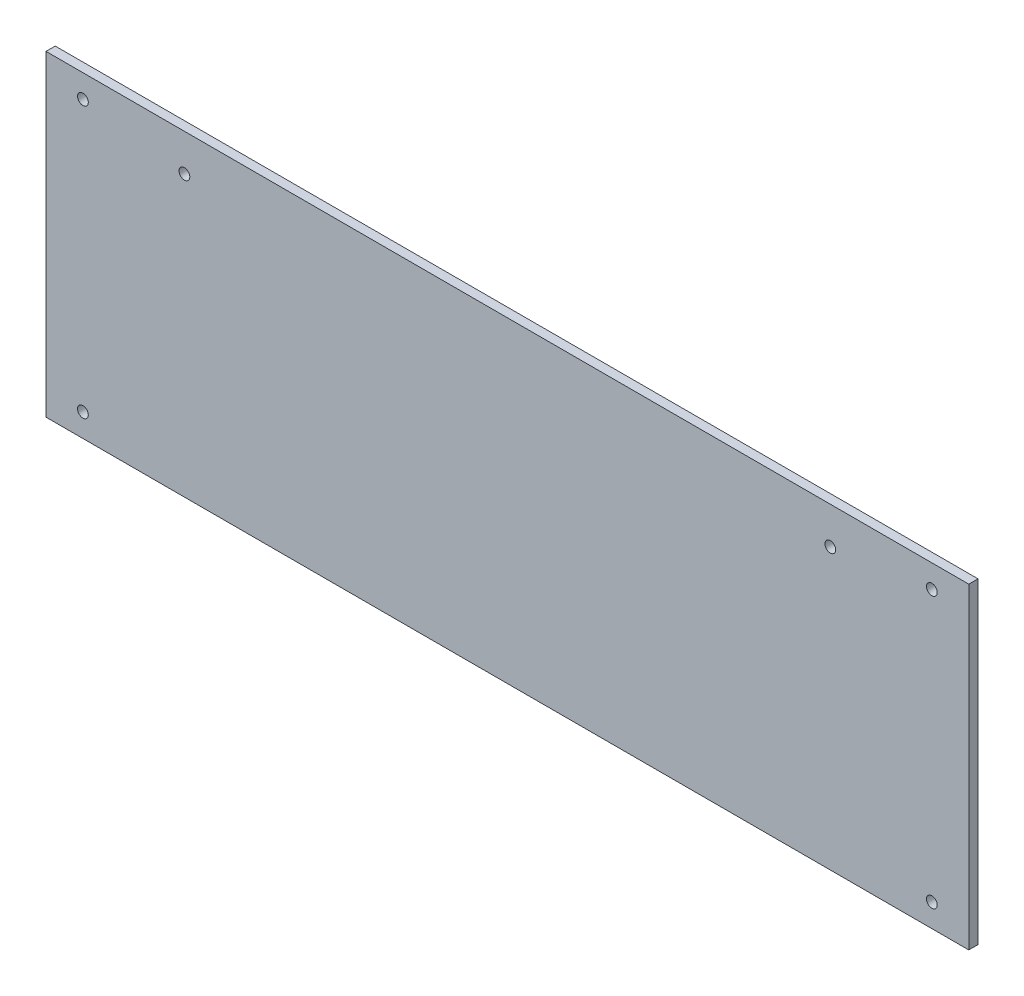
ISO-10303-21;
HEADER;
FILE_DESCRIPTION(('STEP AP214'),'2;1');
FILE_NAME('part.step','',(''),(''),'','','');
FILE_SCHEMA(('AUTOMOTIVE_DESIGN { 1 0 10303 214 1 1 1 1 }'));
ENDSEC;
DATA;
#1=APPLICATION_CONTEXT('core data for automotive mechanical design processes');
#2=APPLICATION_PROTOCOL_DEFINITION('international standard','automotive_design',2000,#1);
#3=PRODUCT_CONTEXT('',#1,'mechanical');
#4=PRODUCT('Part','Part','',(#3));
#5=PRODUCT_RELATED_PRODUCT_CATEGORY('part','',(#4));
#6=PRODUCT_DEFINITION_FORMATION('','',#4);
#7=PRODUCT_DEFINITION_CONTEXT('part definition',#1,'design');
#8=PRODUCT_DEFINITION('design','',#6,#7);
#9=PRODUCT_DEFINITION_SHAPE('','',#8);
#10=(LENGTH_UNIT() NAMED_UNIT(*) SI_UNIT(.MILLI.,.METRE.));
#11=(NAMED_UNIT(*) PLANE_ANGLE_UNIT() SI_UNIT($,.RADIAN.));
#12=(NAMED_UNIT(*) SI_UNIT($,.STERADIAN.) SOLID_ANGLE_UNIT());
#13=UNCERTAINTY_MEASURE_WITH_UNIT(LENGTH_MEASURE(1.E-05),#10,'distance_accuracy_value','');
#14=(GEOMETRIC_REPRESENTATION_CONTEXT(3) GLOBAL_UNCERTAINTY_ASSIGNED_CONTEXT((#13)) GLOBAL_UNIT_ASSIGNED_CONTEXT((#10,
#11,#12)) REPRESENTATION_CONTEXT('',''));
#15=CARTESIAN_POINT('',(0.,0.,0.));
#16=DIRECTION('',(0.,0.,1.));
#17=DIRECTION('',(1.,0.,0.));
#18=AXIS2_PLACEMENT_3D('',#15,#16,#17);
#19=CARTESIAN_POINT('',(0.,100.,0.));
#20=DIRECTION('',(-1.,0.,0.));
#21=DIRECTION('',(0.,0.,1.));
#22=AXIS2_PLACEMENT_3D('',#19,#20,#21);
#23=PLANE('',#22);
#24=DIRECTION('',(0.,-1.,0.));
#25=VECTOR('',#24,1.);
#26=CARTESIAN_POINT('',(0.,100.,3.));
#27=LINE('',#26,#25);
#28=CARTESIAN_POINT('',(0.,100.,3.));
#29=VERTEX_POINT('',#28);
#30=CARTESIAN_POINT('',(0.,-3.,3.));
#31=VERTEX_POINT('',#30);
#32=EDGE_CURVE('E98',#29,#31,#27,.T.);
#33=ORIENTED_EDGE('',*,*,#32,.F.);
#34=DIRECTION('',(0.,0.,1.));
#35=VECTOR('',#34,1.);
#36=CARTESIAN_POINT('',(0.,100.,0.));
#37=LINE('',#36,#35);
#38=CARTESIAN_POINT('',(0.,100.,0.));
#39=VERTEX_POINT('',#38);
#40=EDGE_CURVE('E11',#39,#29,#37,.T.);
#41=ORIENTED_EDGE('',*,*,#40,.F.);
#42=DIRECTION('',(0.,-1.,0.));
#43=VECTOR('',#42,1.);
#44=CARTESIAN_POINT('',(0.,100.,0.));
#45=LINE('',#44,#43);
#46=CARTESIAN_POINT('',(0.,-3.,0.));
#47=VERTEX_POINT('',#46);
#48=EDGE_CURVE('E91',#39,#47,#45,.T.);
#49=ORIENTED_EDGE('',*,*,#48,.T.);
#50=DIRECTION('',(0.,0.,1.));
#51=VECTOR('',#50,1.);
#52=CARTESIAN_POINT('',(0.,-3.,0.));
#53=LINE('',#52,#51);
#54=EDGE_CURVE('E36',#47,#31,#53,.T.);
#55=ORIENTED_EDGE('',*,*,#54,.T.);
#56=EDGE_LOOP('',(#33,#41,#49,#55));
#57=FACE_BOUND('',#56,.T.);
#58=ADVANCED_FACE('F33',(#57),#23,.T.);
#59=CARTESIAN_POINT('',(300.,100.,0.));
#60=DIRECTION('',(0.,1.,0.));
#61=DIRECTION('',(0.,0.,1.));
#62=AXIS2_PLACEMENT_3D('',#59,#60,#61);
#63=PLANE('',#62);
#64=DIRECTION('',(-1.,0.,0.));
#65=VECTOR('',#64,1.);
#66=CARTESIAN_POINT('',(300.,100.,3.));
#67=LINE('',#66,#65);
#68=CARTESIAN_POINT('',(300.,100.,3.));
#69=VERTEX_POINT('',#68);
#70=EDGE_CURVE('E93',#69,#29,#67,.T.);
#71=ORIENTED_EDGE('',*,*,#70,.F.);
#72=DIRECTION('',(0.,0.,1.));
#73=VECTOR('',#72,1.);
#74=CARTESIAN_POINT('',(300.,100.,0.));
#75=LINE('',#74,#73);
#76=CARTESIAN_POINT('',(300.,100.,0.));
#77=VERTEX_POINT('',#76);
#78=EDGE_CURVE('E42',#77,#69,#75,.T.);
#79=ORIENTED_EDGE('',*,*,#78,.F.);
#80=DIRECTION('',(-1.,0.,0.));
#81=VECTOR('',#80,1.);
#82=CARTESIAN_POINT('',(300.,100.,0.));
#83=LINE('',#82,#81);
#84=EDGE_CURVE('E88',#77,#39,#83,.T.);
#85=ORIENTED_EDGE('',*,*,#84,.T.);
#86=ORIENTED_EDGE('',*,*,#40,.T.);
#87=EDGE_LOOP('',(#71,#79,#85,#86));
#88=FACE_BOUND('',#87,.T.);
#89=ADVANCED_FACE('F109',(#88),#63,.T.);
#90=CARTESIAN_POINT('',(300.,-3.,0.));
#91=DIRECTION('',(1.,0.,0.));
#92=DIRECTION('',(0.,0.,-1.));
#93=AXIS2_PLACEMENT_3D('',#90,#91,#92);
#94=PLANE('',#93);
#95=DIRECTION('',(0.,1.,0.));
#96=VECTOR('',#95,1.);
#97=CARTESIAN_POINT('',(300.,-3.,3.));
#98=LINE('',#97,#96);
#99=CARTESIAN_POINT('',(300.,-3.,3.));
#100=VERTEX_POINT('',#99);
#101=EDGE_CURVE('E83',#100,#69,#98,.T.);
#102=ORIENTED_EDGE('',*,*,#101,.F.);
#103=DIRECTION('',(0.,0.,1.));
#104=VECTOR('',#103,1.);
#105=CARTESIAN_POINT('',(300.,-3.,0.));
#106=LINE('',#105,#104);
#107=CARTESIAN_POINT('',(300.,-3.,0.));
#108=VERTEX_POINT('',#107);
#109=EDGE_CURVE('E78',#108,#100,#106,.T.);
#110=ORIENTED_EDGE('',*,*,#109,.F.);
#111=DIRECTION('',(0.,1.,0.));
#112=VECTOR('',#111,1.);
#113=CARTESIAN_POINT('',(300.,-3.,0.));
#114=LINE('',#113,#112);
#115=EDGE_CURVE('E81',#108,#77,#114,.T.);
#116=ORIENTED_EDGE('',*,*,#115,.T.);
#117=ORIENTED_EDGE('',*,*,#78,.T.);
#118=EDGE_LOOP('',(#102,#110,#116,#117));
#119=FACE_BOUND('',#118,.T.);
#120=ADVANCED_FACE('F80',(#119),#94,.T.);
#121=CARTESIAN_POINT('',(0.,-3.,0.));
#122=DIRECTION('',(0.,-1.,0.));
#123=DIRECTION('',(0.,0.,-1.));
#124=AXIS2_PLACEMENT_3D('',#121,#122,#123);
#125=PLANE('',#124);
#126=DIRECTION('',(1.,0.,0.));
#127=VECTOR('',#126,1.);
#128=CARTESIAN_POINT('',(0.,-3.,3.));
#129=LINE('',#128,#127);
#130=EDGE_CURVE('E101',#31,#100,#129,.T.);
#131=ORIENTED_EDGE('',*,*,#130,.F.);
#132=ORIENTED_EDGE('',*,*,#54,.F.);
#133=DIRECTION('',(1.,0.,0.));
#134=VECTOR('',#133,1.);
#135=CARTESIAN_POINT('',(0.,-3.,0.));
#136=LINE('',#135,#134);
#137=EDGE_CURVE('E87',#47,#108,#136,.T.);
#138=ORIENTED_EDGE('',*,*,#137,.T.);
#139=ORIENTED_EDGE('',*,*,#109,.T.);
#140=EDGE_LOOP('',(#131,#132,#138,#139));
#141=FACE_BOUND('',#140,.T.);
#142=ADVANCED_FACE('F90',(#141),#125,.T.);
#143=CARTESIAN_POINT('',(0.,0.,0.));
#144=DIRECTION('',(0.,0.,1.));
#145=DIRECTION('',(1.,0.,0.));
#146=AXIS2_PLACEMENT_3D('',#143,#144,#145);
#147=PLANE('',#146);
#148=CARTESIAN_POINT('',(255.,88.,0.));
#149=DIRECTION('',(0.,0.,1.));
#150=DIRECTION('',(-1.,0.,0.));
#151=AXIS2_PLACEMENT_3D('',#148,#149,#150);
#152=CIRCLE('',#151,1.75000000000003);
#153=CARTESIAN_POINT('',(253.25,88.,0.));
#154=VERTEX_POINT('',#153);
#155=EDGE_CURVE('E158',#154,#154,#152,.T.);
#156=ORIENTED_EDGE('',*,*,#155,.T.);
#157=EDGE_LOOP('',(#156));
#158=FACE_BOUND('',#157,.T.);
#159=CARTESIAN_POINT('',(45.,88.,0.));
#160=DIRECTION('',(0.,0.,1.));
#161=DIRECTION('',(-1.,0.,0.));
#162=AXIS2_PLACEMENT_3D('',#159,#160,#161);
#163=CIRCLE('',#162,1.75);
#164=CARTESIAN_POINT('',(43.25,88.,0.));
#165=VERTEX_POINT('',#164);
#166=EDGE_CURVE('E166',#165,#165,#163,.T.);
#167=ORIENTED_EDGE('',*,*,#166,.T.);
#168=EDGE_LOOP('',(#167));
#169=FACE_BOUND('',#168,.T.);
#170=CARTESIAN_POINT('',(288.,4.5,0.));
#171=DIRECTION('',(0.,0.,1.));
#172=DIRECTION('',(-1.,0.,0.));
#173=AXIS2_PLACEMENT_3D('',#170,#171,#172);
#174=CIRCLE('',#173,1.74999999999997);
#175=CARTESIAN_POINT('',(286.25,4.5,0.));
#176=VERTEX_POINT('',#175);
#177=EDGE_CURVE('E172',#176,#176,#174,.T.);
#178=ORIENTED_EDGE('',*,*,#177,.T.);
#179=EDGE_LOOP('',(#178));
#180=FACE_BOUND('',#179,.T.);
#181=CARTESIAN_POINT('',(12.,4.50000000000003,0.));
#182=DIRECTION('',(0.,0.,1.));
#183=DIRECTION('',(-1.,0.,0.));
#184=AXIS2_PLACEMENT_3D('',#181,#182,#183);
#185=CIRCLE('',#184,1.74999999999998);
#186=CARTESIAN_POINT('',(10.25,4.50000000000003,0.));
#187=VERTEX_POINT('',#186);
#188=EDGE_CURVE('E178',#187,#187,#185,.T.);
#189=ORIENTED_EDGE('',*,*,#188,.T.);
#190=EDGE_LOOP('',(#189));
#191=FACE_BOUND('',#190,.T.);
#192=CARTESIAN_POINT('',(12.,92.5,0.));
#193=DIRECTION('',(0.,0.,1.));
#194=DIRECTION('',(-1.,0.,0.));
#195=AXIS2_PLACEMENT_3D('',#192,#193,#194);
#196=CIRCLE('',#195,1.74999999999998);
#197=CARTESIAN_POINT('',(10.25,92.5,0.));
#198=VERTEX_POINT('',#197);
#199=EDGE_CURVE('E184',#198,#198,#196,.T.);
#200=ORIENTED_EDGE('',*,*,#199,.T.);
#201=EDGE_LOOP('',(#200));
#202=FACE_BOUND('',#201,.T.);
#203=CARTESIAN_POINT('',(288.,92.5,0.));
#204=DIRECTION('',(0.,0.,1.));
#205=DIRECTION('',(-1.,0.,0.));
#206=AXIS2_PLACEMENT_3D('',#203,#204,#205);
#207=CIRCLE('',#206,1.74999999999997);
#208=CARTESIAN_POINT('',(286.25,92.5,0.));
#209=VERTEX_POINT('',#208);
#210=EDGE_CURVE('E102',#209,#209,#207,.T.);
#211=ORIENTED_EDGE('',*,*,#210,.T.);
#212=EDGE_LOOP('',(#211));
#213=FACE_BOUND('',#212,.T.);
#214=ORIENTED_EDGE('',*,*,#48,.F.);
#215=ORIENTED_EDGE('',*,*,#84,.F.);
#216=ORIENTED_EDGE('',*,*,#115,.F.);
#217=ORIENTED_EDGE('',*,*,#137,.F.);
#218=EDGE_LOOP('',(#214,#215,#216,#217));
#219=FACE_BOUND('',#218,.T.);
#220=ADVANCED_FACE('F86',(#158,#169,#180,#191,#202,#213,#219),#147,.F.);
#221=CARTESIAN_POINT('',(0.,0.,3.));
#222=DIRECTION('',(0.,0.,1.));
#223=DIRECTION('',(1.,0.,0.));
#224=AXIS2_PLACEMENT_3D('',#221,#222,#223);
#225=PLANE('',#224);
#226=CARTESIAN_POINT('',(255.,88.,3.));
#227=DIRECTION('',(0.,0.,1.));
#228=DIRECTION('',(-1.,0.,0.));
#229=AXIS2_PLACEMENT_3D('',#226,#227,#228);
#230=CIRCLE('',#229,1.75000000000003);
#231=CARTESIAN_POINT('',(253.25,88.,3.));
#232=VERTEX_POINT('',#231);
#233=EDGE_CURVE('E161',#232,#232,#230,.T.);
#234=ORIENTED_EDGE('',*,*,#233,.F.);
#235=EDGE_LOOP('',(#234));
#236=FACE_BOUND('',#235,.T.);
#237=CARTESIAN_POINT('',(45.,88.,3.));
#238=DIRECTION('',(0.,0.,1.));
#239=DIRECTION('',(-1.,0.,0.));
#240=AXIS2_PLACEMENT_3D('',#237,#238,#239);
#241=CIRCLE('',#240,1.75);
#242=CARTESIAN_POINT('',(43.25,88.,3.));
#243=VERTEX_POINT('',#242);
#244=EDGE_CURVE('E163',#243,#243,#241,.T.);
#245=ORIENTED_EDGE('',*,*,#244,.F.);
#246=EDGE_LOOP('',(#245));
#247=FACE_BOUND('',#246,.T.);
#248=CARTESIAN_POINT('',(288.,4.5,3.));
#249=DIRECTION('',(0.,0.,1.));
#250=DIRECTION('',(-1.,0.,0.));
#251=AXIS2_PLACEMENT_3D('',#248,#249,#250);
#252=CIRCLE('',#251,1.74999999999997);
#253=CARTESIAN_POINT('',(286.25,4.5,3.));
#254=VERTEX_POINT('',#253);
#255=EDGE_CURVE('E169',#254,#254,#252,.T.);
#256=ORIENTED_EDGE('',*,*,#255,.F.);
#257=EDGE_LOOP('',(#256));
#258=FACE_BOUND('',#257,.T.);
#259=CARTESIAN_POINT('',(12.,4.50000000000003,3.));
#260=DIRECTION('',(0.,0.,1.));
#261=DIRECTION('',(-1.,0.,0.));
#262=AXIS2_PLACEMENT_3D('',#259,#260,#261);
#263=CIRCLE('',#262,1.74999999999998);
#264=CARTESIAN_POINT('',(10.25,4.50000000000003,3.));
#265=VERTEX_POINT('',#264);
#266=EDGE_CURVE('E175',#265,#265,#263,.T.);
#267=ORIENTED_EDGE('',*,*,#266,.F.);
#268=EDGE_LOOP('',(#267));
#269=FACE_BOUND('',#268,.T.);
#270=CARTESIAN_POINT('',(12.,92.5,3.));
#271=DIRECTION('',(0.,0.,1.));
#272=DIRECTION('',(-1.,0.,0.));
#273=AXIS2_PLACEMENT_3D('',#270,#271,#272);
#274=CIRCLE('',#273,1.74999999999998);
#275=CARTESIAN_POINT('',(10.25,92.5,3.));
#276=VERTEX_POINT('',#275);
#277=EDGE_CURVE('E181',#276,#276,#274,.T.);
#278=ORIENTED_EDGE('',*,*,#277,.F.);
#279=EDGE_LOOP('',(#278));
#280=FACE_BOUND('',#279,.T.);
#281=CARTESIAN_POINT('',(288.,92.5,3.));
#282=DIRECTION('',(0.,0.,1.));
#283=DIRECTION('',(-1.,0.,0.));
#284=AXIS2_PLACEMENT_3D('',#281,#282,#283);
#285=CIRCLE('',#284,1.74999999999997);
#286=CARTESIAN_POINT('',(286.25,92.5,3.));
#287=VERTEX_POINT('',#286);
#288=EDGE_CURVE('E187',#287,#287,#285,.T.);
#289=ORIENTED_EDGE('',*,*,#288,.F.);
#290=EDGE_LOOP('',(#289));
#291=FACE_BOUND('',#290,.T.);
#292=ORIENTED_EDGE('',*,*,#32,.T.);
#293=ORIENTED_EDGE('',*,*,#130,.T.);
#294=ORIENTED_EDGE('',*,*,#101,.T.);
#295=ORIENTED_EDGE('',*,*,#70,.T.);
#296=EDGE_LOOP('',(#292,#293,#294,#295));
#297=FACE_BOUND('',#296,.T.);
#298=ADVANCED_FACE('F108',(#236,#247,#258,#269,#280,#291,#297),#225,.T.);
#299=CARTESIAN_POINT('',(288.,92.5,0.));
#300=DIRECTION('',(0.,0.,1.));
#301=DIRECTION('',(1.,0.,0.));
#302=AXIS2_PLACEMENT_3D('',#299,#300,#301);
#303=CYLINDRICAL_SURFACE('',#302,1.74999999999997);
#304=ORIENTED_EDGE('',*,*,#210,.F.);
#305=EDGE_LOOP('',(#304));
#306=FACE_BOUND('',#305,.T.);
#307=ORIENTED_EDGE('',*,*,#288,.T.);
#308=EDGE_LOOP('',(#307));
#309=FACE_BOUND('',#308,.T.);
#310=ADVANCED_FACE('F127',(#306,#309),#303,.F.);
#311=CARTESIAN_POINT('',(12.,92.5,0.));
#312=DIRECTION('',(0.,0.,1.));
#313=DIRECTION('',(1.,0.,0.));
#314=AXIS2_PLACEMENT_3D('',#311,#312,#313);
#315=CYLINDRICAL_SURFACE('',#314,1.74999999999998);
#316=ORIENTED_EDGE('',*,*,#199,.F.);
#317=EDGE_LOOP('',(#316));
#318=FACE_BOUND('',#317,.T.);
#319=ORIENTED_EDGE('',*,*,#277,.T.);
#320=EDGE_LOOP('',(#319));
#321=FACE_BOUND('',#320,.T.);
#322=ADVANCED_FACE('F134',(#318,#321),#315,.F.);
#323=CARTESIAN_POINT('',(12.,4.50000000000003,0.));
#324=DIRECTION('',(0.,0.,1.));
#325=DIRECTION('',(1.,0.,0.));
#326=AXIS2_PLACEMENT_3D('',#323,#324,#325);
#327=CYLINDRICAL_SURFACE('',#326,1.74999999999998);
#328=ORIENTED_EDGE('',*,*,#188,.F.);
#329=EDGE_LOOP('',(#328));
#330=FACE_BOUND('',#329,.T.);
#331=ORIENTED_EDGE('',*,*,#266,.T.);
#332=EDGE_LOOP('',(#331));
#333=FACE_BOUND('',#332,.T.);
#334=ADVANCED_FACE('F138',(#330,#333),#327,.F.);
#335=CARTESIAN_POINT('',(288.,4.5,0.));
#336=DIRECTION('',(0.,0.,1.));
#337=DIRECTION('',(1.,0.,0.));
#338=AXIS2_PLACEMENT_3D('',#335,#336,#337);
#339=CYLINDRICAL_SURFACE('',#338,1.74999999999997);
#340=ORIENTED_EDGE('',*,*,#177,.F.);
#341=EDGE_LOOP('',(#340));
#342=FACE_BOUND('',#341,.T.);
#343=ORIENTED_EDGE('',*,*,#255,.T.);
#344=EDGE_LOOP('',(#343));
#345=FACE_BOUND('',#344,.T.);
#346=ADVANCED_FACE('F142',(#342,#345),#339,.F.);
#347=CARTESIAN_POINT('',(45.,88.,0.));
#348=DIRECTION('',(0.,0.,1.));
#349=DIRECTION('',(1.,0.,0.));
#350=AXIS2_PLACEMENT_3D('',#347,#348,#349);
#351=CYLINDRICAL_SURFACE('',#350,1.75);
#352=ORIENTED_EDGE('',*,*,#166,.F.);
#353=EDGE_LOOP('',(#352));
#354=FACE_BOUND('',#353,.T.);
#355=ORIENTED_EDGE('',*,*,#244,.T.);
#356=EDGE_LOOP('',(#355));
#357=FACE_BOUND('',#356,.T.);
#358=ADVANCED_FACE('F146',(#354,#357),#351,.F.);
#359=CARTESIAN_POINT('',(255.,88.,0.));
#360=DIRECTION('',(0.,0.,1.));
#361=DIRECTION('',(1.,0.,0.));
#362=AXIS2_PLACEMENT_3D('',#359,#360,#361);
#363=CYLINDRICAL_SURFACE('',#362,1.75000000000003);
#364=ORIENTED_EDGE('',*,*,#155,.F.);
#365=EDGE_LOOP('',(#364));
#366=FACE_BOUND('',#365,.T.);
#367=ORIENTED_EDGE('',*,*,#233,.T.);
#368=EDGE_LOOP('',(#367));
#369=FACE_BOUND('',#368,.T.);
#370=ADVANCED_FACE('F150',(#366,#369),#363,.F.);
#371=CLOSED_SHELL('',(#58,#89,#120,#142,#220,#298,#310,#322,#334,#346,#358,#370));
#372=MANIFOLD_SOLID_BREP('B2',#371);
#373=ADVANCED_BREP_SHAPE_REPRESENTATION('',(#18,#372),#14);
#374=SHAPE_DEFINITION_REPRESENTATION(#9,#373);
ENDSEC;
END-ISO-10303-21;
